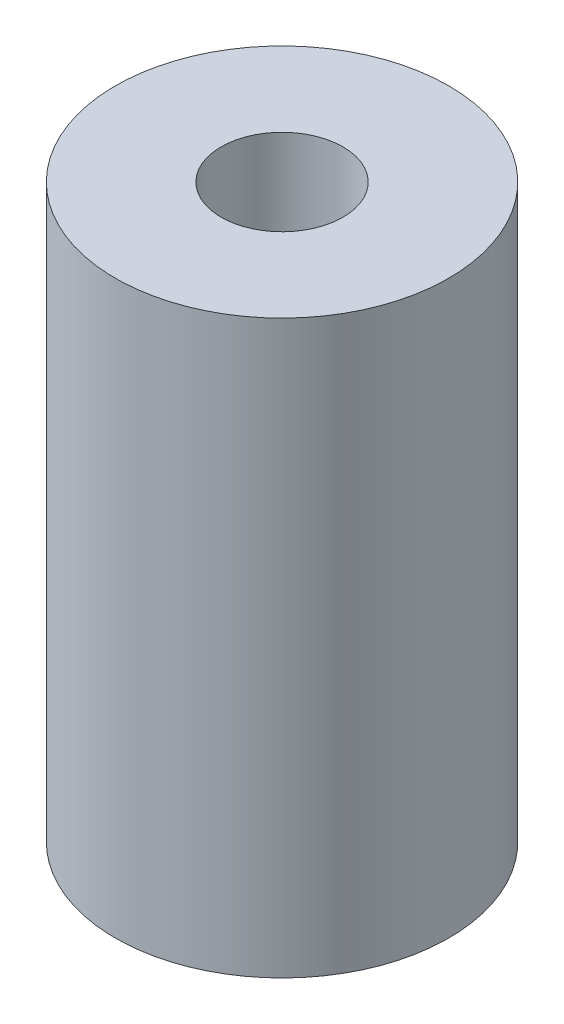
ISO-10303-21;
HEADER;
FILE_DESCRIPTION(('STEP AP214'),'2;1');
FILE_NAME('part.step','',(''),(''),'','','');
FILE_SCHEMA(('AUTOMOTIVE_DESIGN { 1 0 10303 214 1 1 1 1 }'));
ENDSEC;
DATA;
#1=APPLICATION_CONTEXT('core data for automotive mechanical design processes');
#2=APPLICATION_PROTOCOL_DEFINITION('international standard','automotive_design',2000,#1);
#3=PRODUCT_CONTEXT('',#1,'mechanical');
#4=PRODUCT('Part','Part','',(#3));
#5=PRODUCT_RELATED_PRODUCT_CATEGORY('part','',(#4));
#6=PRODUCT_DEFINITION_FORMATION('','',#4);
#7=PRODUCT_DEFINITION_CONTEXT('part definition',#1,'design');
#8=PRODUCT_DEFINITION('design','',#6,#7);
#9=PRODUCT_DEFINITION_SHAPE('','',#8);
#10=(LENGTH_UNIT() NAMED_UNIT(*) SI_UNIT(.MILLI.,.METRE.));
#11=(NAMED_UNIT(*) PLANE_ANGLE_UNIT() SI_UNIT($,.RADIAN.));
#12=(NAMED_UNIT(*) SI_UNIT($,.STERADIAN.) SOLID_ANGLE_UNIT());
#13=UNCERTAINTY_MEASURE_WITH_UNIT(LENGTH_MEASURE(1.E-05),#10,'distance_accuracy_value','');
#14=(GEOMETRIC_REPRESENTATION_CONTEXT(3) GLOBAL_UNCERTAINTY_ASSIGNED_CONTEXT((#13)) GLOBAL_UNIT_ASSIGNED_CONTEXT((#10,
#11,#12)) REPRESENTATION_CONTEXT('',''));
#15=CARTESIAN_POINT('',(0.,0.,0.));
#16=DIRECTION('',(0.,0.,1.));
#17=DIRECTION('',(1.,0.,0.));
#18=AXIS2_PLACEMENT_3D('',#15,#16,#17);
#19=CARTESIAN_POINT('',(0.,0.,0.));
#20=DIRECTION('',(0.,-1.,0.));
#21=DIRECTION('',(0.,0.,-1.));
#22=AXIS2_PLACEMENT_3D('',#19,#20,#21);
#23=CYLINDRICAL_SURFACE('',#22,4.064);
#24=CARTESIAN_POINT('',(0.,0.,0.));
#25=DIRECTION('',(0.,-1.,0.));
#26=DIRECTION('',(0.,0.,-1.));
#27=AXIS2_PLACEMENT_3D('',#24,#25,#26);
#28=CIRCLE('',#27,4.064);
#29=CARTESIAN_POINT('',(0.,0.,-4.064));
#30=VERTEX_POINT('',#29);
#31=EDGE_CURVE('E49',#30,#30,#28,.T.);
#32=ORIENTED_EDGE('',*,*,#31,.T.);
#33=EDGE_LOOP('',(#32));
#34=FACE_BOUND('',#33,.T.);
#35=CARTESIAN_POINT('',(0.,38.1,0.));
#36=DIRECTION('',(0.,-1.,0.));
#37=DIRECTION('',(0.,0.,-1.));
#38=AXIS2_PLACEMENT_3D('',#35,#36,#37);
#39=CIRCLE('',#38,4.064);
#40=CARTESIAN_POINT('',(0.,38.1,-4.064));
#41=VERTEX_POINT('',#40);
#42=EDGE_CURVE('E10',#41,#41,#39,.T.);
#43=ORIENTED_EDGE('',*,*,#42,.F.);
#44=EDGE_LOOP('',(#43));
#45=FACE_BOUND('',#44,.T.);
#46=ADVANCED_FACE('F35',(#34,#45),#23,.F.);
#47=CARTESIAN_POINT('',(4.064,38.1,0.));
#48=DIRECTION('',(0.,1.,0.));
#49=DIRECTION('',(0.,0.,1.));
#50=AXIS2_PLACEMENT_3D('',#47,#48,#49);
#51=PLANE('',#50);
#52=ORIENTED_EDGE('',*,*,#42,.T.);
#53=EDGE_LOOP('',(#52));
#54=FACE_BOUND('',#53,.T.);
#55=CARTESIAN_POINT('',(0.,38.1,0.));
#56=DIRECTION('',(0.,-1.,0.));
#57=DIRECTION('',(0.,0.,-1.));
#58=AXIS2_PLACEMENT_3D('',#55,#56,#57);
#59=CIRCLE('',#58,11.1125);
#60=CARTESIAN_POINT('',(0.,38.1,-11.1125));
#61=VERTEX_POINT('',#60);
#62=EDGE_CURVE('E41',#61,#61,#59,.T.);
#63=ORIENTED_EDGE('',*,*,#62,.F.);
#64=EDGE_LOOP('',(#63));
#65=FACE_BOUND('',#64,.T.);
#66=ADVANCED_FACE('F65',(#54,#65),#51,.T.);
#67=CARTESIAN_POINT('',(0.,0.,0.));
#68=DIRECTION('',(0.,-1.,0.));
#69=DIRECTION('',(0.,0.,-1.));
#70=AXIS2_PLACEMENT_3D('',#67,#68,#69);
#71=CYLINDRICAL_SURFACE('',#70,11.1125);
#72=ORIENTED_EDGE('',*,*,#62,.T.);
#73=EDGE_LOOP('',(#72));
#74=FACE_BOUND('',#73,.T.);
#75=CARTESIAN_POINT('',(0.,0.,0.));
#76=DIRECTION('',(0.,-1.,0.));
#77=DIRECTION('',(0.,0.,-1.));
#78=AXIS2_PLACEMENT_3D('',#75,#76,#77);
#79=CIRCLE('',#78,11.1125);
#80=CARTESIAN_POINT('',(0.,0.,-11.1125));
#81=VERTEX_POINT('',#80);
#82=EDGE_CURVE('E45',#81,#81,#79,.T.);
#83=ORIENTED_EDGE('',*,*,#82,.F.);
#84=EDGE_LOOP('',(#83));
#85=FACE_BOUND('',#84,.T.);
#86=ADVANCED_FACE('F59',(#74,#85),#71,.T.);
#87=CARTESIAN_POINT('',(4.064,0.,0.));
#88=DIRECTION('',(0.,-1.,0.));
#89=DIRECTION('',(0.,0.,-1.));
#90=AXIS2_PLACEMENT_3D('',#87,#88,#89);
#91=PLANE('',#90);
#92=ORIENTED_EDGE('',*,*,#82,.T.);
#93=EDGE_LOOP('',(#92));
#94=FACE_BOUND('',#93,.T.);
#95=ORIENTED_EDGE('',*,*,#31,.F.);
#96=EDGE_LOOP('',(#95));
#97=FACE_BOUND('',#96,.T.);
#98=ADVANCED_FACE('F57',(#94,#97),#91,.T.);
#99=CLOSED_SHELL('',(#46,#66,#86,#98));
#100=MANIFOLD_SOLID_BREP('B2',#99);
#101=ADVANCED_BREP_SHAPE_REPRESENTATION('',(#18,#100),#14);
#102=SHAPE_DEFINITION_REPRESENTATION(#9,#101);
ENDSEC;
END-ISO-10303-21;
